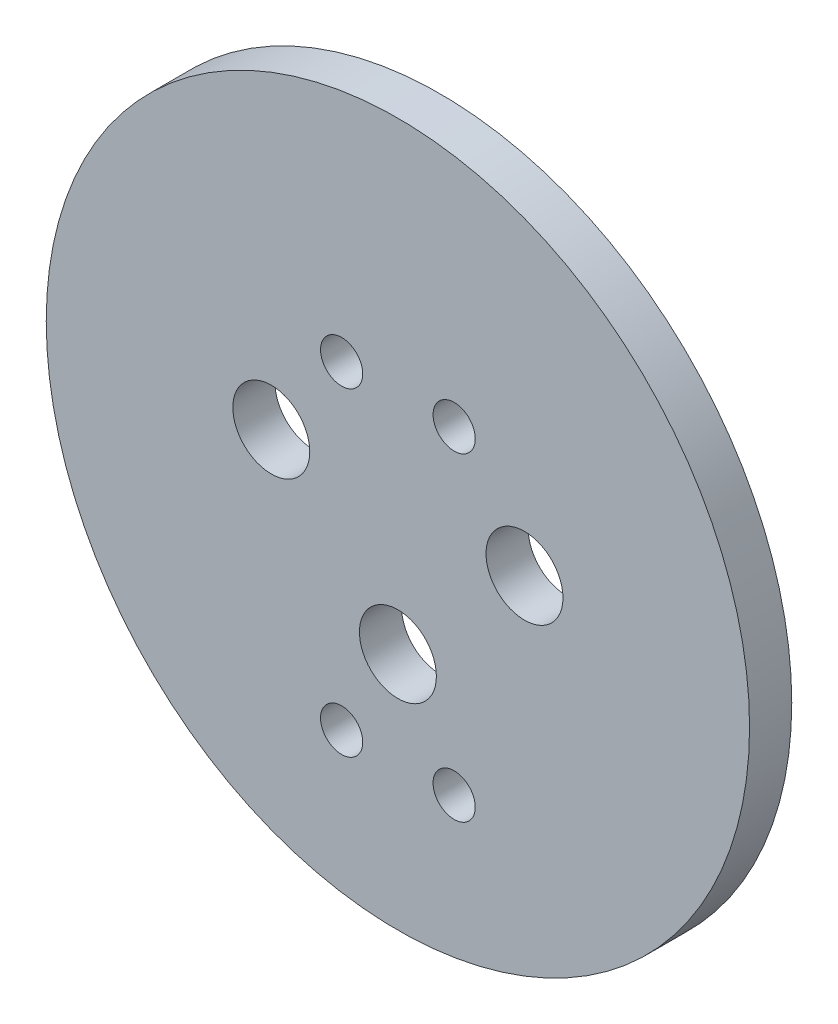
ISO-10303-21;
HEADER;
FILE_DESCRIPTION(('STEP AP214'),'2;1');
FILE_NAME('part.step','',(''),(''),'','','');
FILE_SCHEMA(('AUTOMOTIVE_DESIGN { 1 0 10303 214 1 1 1 1 }'));
ENDSEC;
DATA;
#1=APPLICATION_CONTEXT('core data for automotive mechanical design processes');
#2=APPLICATION_PROTOCOL_DEFINITION('international standard','automotive_design',2000,#1);
#3=PRODUCT_CONTEXT('',#1,'mechanical');
#4=PRODUCT('Part','Part','',(#3));
#5=PRODUCT_RELATED_PRODUCT_CATEGORY('part','',(#4));
#6=PRODUCT_DEFINITION_FORMATION('','',#4);
#7=PRODUCT_DEFINITION_CONTEXT('part definition',#1,'design');
#8=PRODUCT_DEFINITION('design','',#6,#7);
#9=PRODUCT_DEFINITION_SHAPE('','',#8);
#10=(LENGTH_UNIT() NAMED_UNIT(*) SI_UNIT(.MILLI.,.METRE.));
#11=(NAMED_UNIT(*) PLANE_ANGLE_UNIT() SI_UNIT($,.RADIAN.));
#12=(NAMED_UNIT(*) SI_UNIT($,.STERADIAN.) SOLID_ANGLE_UNIT());
#13=UNCERTAINTY_MEASURE_WITH_UNIT(LENGTH_MEASURE(1.E-05),#10,'distance_accuracy_value','');
#14=(GEOMETRIC_REPRESENTATION_CONTEXT(3) GLOBAL_UNCERTAINTY_ASSIGNED_CONTEXT((#13)) GLOBAL_UNIT_ASSIGNED_CONTEXT((#10,
#11,#12)) REPRESENTATION_CONTEXT('',''));
#15=CARTESIAN_POINT('',(0.,0.,0.));
#16=DIRECTION('',(0.,0.,1.));
#17=DIRECTION('',(1.,0.,0.));
#18=AXIS2_PLACEMENT_3D('',#15,#16,#17);
#19=CARTESIAN_POINT('',(0.,0.,3.));
#20=DIRECTION('',(0.,0.,-1.));
#21=DIRECTION('',(-1.,0.,0.));
#22=AXIS2_PLACEMENT_3D('',#19,#20,#21);
#23=CYLINDRICAL_SURFACE('',#22,25.);
#24=CARTESIAN_POINT('',(0.,0.,3.));
#25=DIRECTION('',(0.,0.,1.));
#26=DIRECTION('',(1.,0.,0.));
#27=AXIS2_PLACEMENT_3D('',#24,#25,#26);
#28=CIRCLE('',#27,25.);
#29=CARTESIAN_POINT('',(25.,0.,3.));
#30=VERTEX_POINT('',#29);
#31=EDGE_CURVE('E10',#30,#30,#28,.T.);
#32=ORIENTED_EDGE('',*,*,#31,.F.);
#33=EDGE_LOOP('',(#32));
#34=FACE_BOUND('',#33,.T.);
#35=CARTESIAN_POINT('',(0.,0.,0.));
#36=DIRECTION('',(0.,0.,1.));
#37=DIRECTION('',(1.,0.,0.));
#38=AXIS2_PLACEMENT_3D('',#35,#36,#37);
#39=CIRCLE('',#38,25.);
#40=CARTESIAN_POINT('',(25.,0.,0.));
#41=VERTEX_POINT('',#40);
#42=EDGE_CURVE('E43',#41,#41,#39,.T.);
#43=ORIENTED_EDGE('',*,*,#42,.T.);
#44=EDGE_LOOP('',(#43));
#45=FACE_BOUND('',#44,.T.);
#46=ADVANCED_FACE('F40',(#34,#45),#23,.T.);
#47=CARTESIAN_POINT('',(0.,0.,3.));
#48=DIRECTION('',(0.,0.,1.));
#49=DIRECTION('',(1.,0.,0.));
#50=AXIS2_PLACEMENT_3D('',#47,#48,#49);
#51=PLANE('',#50);
#52=CARTESIAN_POINT('',(0.,-8.,3.));
#53=DIRECTION('',(0.,0.,1.));
#54=DIRECTION('',(1.,0.,0.));
#55=AXIS2_PLACEMENT_3D('',#52,#53,#54);
#56=CIRCLE('',#55,2.735);
#57=CARTESIAN_POINT('',(2.735,-8.,3.));
#58=VERTEX_POINT('',#57);
#59=EDGE_CURVE('E82',#58,#58,#56,.T.);
#60=ORIENTED_EDGE('',*,*,#59,.F.);
#61=EDGE_LOOP('',(#60));
#62=FACE_BOUND('',#61,.T.);
#63=CARTESIAN_POINT('',(-4.,-14.6779253585061,3.));
#64=DIRECTION('',(0.,0.,1.));
#65=DIRECTION('',(-1.,0.,0.));
#66=AXIS2_PLACEMENT_3D('',#63,#64,#65);
#67=CIRCLE('',#66,1.5);
#68=CARTESIAN_POINT('',(-5.5,-14.6779253585061,3.));
#69=VERTEX_POINT('',#68);
#70=EDGE_CURVE('E67',#69,#69,#67,.T.);
#71=ORIENTED_EDGE('',*,*,#70,.F.);
#72=EDGE_LOOP('',(#71));
#73=FACE_BOUND('',#72,.T.);
#74=CARTESIAN_POINT('',(4.,-14.6779253585061,3.));
#75=DIRECTION('',(0.,0.,1.));
#76=DIRECTION('',(-1.,0.,0.));
#77=AXIS2_PLACEMENT_3D('',#74,#75,#76);
#78=CIRCLE('',#77,1.5);
#79=CARTESIAN_POINT('',(2.5,-14.6779253585061,3.));
#80=VERTEX_POINT('',#79);
#81=EDGE_CURVE('E66',#80,#80,#78,.T.);
#82=ORIENTED_EDGE('',*,*,#81,.F.);
#83=EDGE_LOOP('',(#82));
#84=FACE_BOUND('',#83,.T.);
#85=CARTESIAN_POINT('',(4.,8.,3.));
#86=DIRECTION('',(0.,0.,1.));
#87=DIRECTION('',(1.,0.,0.));
#88=AXIS2_PLACEMENT_3D('',#85,#86,#87);
#89=CIRCLE('',#88,1.5);
#90=CARTESIAN_POINT('',(5.5,8.,3.));
#91=VERTEX_POINT('',#90);
#92=EDGE_CURVE('E58',#91,#91,#89,.T.);
#93=ORIENTED_EDGE('',*,*,#92,.F.);
#94=EDGE_LOOP('',(#93));
#95=FACE_BOUND('',#94,.T.);
#96=CARTESIAN_POINT('',(9.,1.32380757938121,3.));
#97=DIRECTION('',(0.,0.,1.));
#98=DIRECTION('',(1.,0.,0.));
#99=AXIS2_PLACEMENT_3D('',#96,#97,#98);
#100=CIRCLE('',#99,2.735);
#101=CARTESIAN_POINT('',(11.735,1.32380757938121,3.));
#102=VERTEX_POINT('',#101);
#103=EDGE_CURVE('E83',#102,#102,#100,.T.);
#104=ORIENTED_EDGE('',*,*,#103,.F.);
#105=EDGE_LOOP('',(#104));
#106=FACE_BOUND('',#105,.T.);
#107=CARTESIAN_POINT('',(-9.,1.32380757938121,3.));
#108=DIRECTION('',(0.,0.,1.));
#109=DIRECTION('',(1.,0.,0.));
#110=AXIS2_PLACEMENT_3D('',#107,#108,#109);
#111=CIRCLE('',#110,2.735);
#112=CARTESIAN_POINT('',(-6.265,1.32380757938121,3.));
#113=VERTEX_POINT('',#112);
#114=EDGE_CURVE('E98',#113,#113,#111,.T.);
#115=ORIENTED_EDGE('',*,*,#114,.F.);
#116=EDGE_LOOP('',(#115));
#117=FACE_BOUND('',#116,.T.);
#118=CARTESIAN_POINT('',(-4.,8.,3.));
#119=DIRECTION('',(0.,0.,1.));
#120=DIRECTION('',(1.,0.,0.));
#121=AXIS2_PLACEMENT_3D('',#118,#119,#120);
#122=CIRCLE('',#121,1.5);
#123=CARTESIAN_POINT('',(-2.5,8.,3.));
#124=VERTEX_POINT('',#123);
#125=EDGE_CURVE('E54',#124,#124,#122,.T.);
#126=ORIENTED_EDGE('',*,*,#125,.F.);
#127=EDGE_LOOP('',(#126));
#128=FACE_BOUND('',#127,.T.);
#129=ORIENTED_EDGE('',*,*,#31,.T.);
#130=EDGE_LOOP('',(#129));
#131=FACE_BOUND('',#130,.T.);
#132=ADVANCED_FACE('F112',(#62,#73,#84,#95,#106,#117,#128,#131),#51,.T.);
#133=CARTESIAN_POINT('',(0.,0.,0.));
#134=DIRECTION('',(0.,0.,1.));
#135=DIRECTION('',(1.,0.,0.));
#136=AXIS2_PLACEMENT_3D('',#133,#134,#135);
#137=PLANE('',#136);
#138=CARTESIAN_POINT('',(0.,-8.,0.));
#139=DIRECTION('',(0.,0.,1.));
#140=DIRECTION('',(1.,0.,0.));
#141=AXIS2_PLACEMENT_3D('',#138,#139,#140);
#142=CIRCLE('',#141,2.735);
#143=CARTESIAN_POINT('',(2.735,-8.,0.));
#144=VERTEX_POINT('',#143);
#145=EDGE_CURVE('E78',#144,#144,#142,.T.);
#146=ORIENTED_EDGE('',*,*,#145,.T.);
#147=EDGE_LOOP('',(#146));
#148=FACE_BOUND('',#147,.T.);
#149=CARTESIAN_POINT('',(-4.,-14.6779253585061,0.));
#150=DIRECTION('',(0.,0.,1.));
#151=DIRECTION('',(-1.,0.,0.));
#152=AXIS2_PLACEMENT_3D('',#149,#150,#151);
#153=CIRCLE('',#152,1.5);
#154=CARTESIAN_POINT('',(-5.5,-14.6779253585061,0.));
#155=VERTEX_POINT('',#154);
#156=EDGE_CURVE('E87',#155,#155,#153,.T.);
#157=ORIENTED_EDGE('',*,*,#156,.T.);
#158=EDGE_LOOP('',(#157));
#159=FACE_BOUND('',#158,.T.);
#160=CARTESIAN_POINT('',(4.,-14.6779253585061,0.));
#161=DIRECTION('',(0.,0.,1.));
#162=DIRECTION('',(-1.,0.,0.));
#163=AXIS2_PLACEMENT_3D('',#160,#161,#162);
#164=CIRCLE('',#163,1.5);
#165=CARTESIAN_POINT('',(2.5,-14.6779253585061,0.));
#166=VERTEX_POINT('',#165);
#167=EDGE_CURVE('E62',#166,#166,#164,.T.);
#168=ORIENTED_EDGE('',*,*,#167,.T.);
#169=EDGE_LOOP('',(#168));
#170=FACE_BOUND('',#169,.T.);
#171=CARTESIAN_POINT('',(4.,8.,0.));
#172=DIRECTION('',(0.,0.,1.));
#173=DIRECTION('',(1.,0.,0.));
#174=AXIS2_PLACEMENT_3D('',#171,#172,#173);
#175=CIRCLE('',#174,1.5);
#176=CARTESIAN_POINT('',(5.5,8.,0.));
#177=VERTEX_POINT('',#176);
#178=EDGE_CURVE('E71',#177,#177,#175,.T.);
#179=ORIENTED_EDGE('',*,*,#178,.T.);
#180=EDGE_LOOP('',(#179));
#181=FACE_BOUND('',#180,.T.);
#182=CARTESIAN_POINT('',(9.,1.32380757938121,0.));
#183=DIRECTION('',(0.,0.,1.));
#184=DIRECTION('',(1.,0.,0.));
#185=AXIS2_PLACEMENT_3D('',#182,#183,#184);
#186=CIRCLE('',#185,2.735);
#187=CARTESIAN_POINT('',(11.735,1.32380757938121,0.));
#188=VERTEX_POINT('',#187);
#189=EDGE_CURVE('E102',#188,#188,#186,.T.);
#190=ORIENTED_EDGE('',*,*,#189,.T.);
#191=EDGE_LOOP('',(#190));
#192=FACE_BOUND('',#191,.T.);
#193=CARTESIAN_POINT('',(-9.,1.32380757938121,0.));
#194=DIRECTION('',(0.,0.,1.));
#195=DIRECTION('',(1.,0.,0.));
#196=AXIS2_PLACEMENT_3D('',#193,#194,#195);
#197=CIRCLE('',#196,2.735);
#198=CARTESIAN_POINT('',(-6.265,1.32380757938121,0.));
#199=VERTEX_POINT('',#198);
#200=EDGE_CURVE('E94',#199,#199,#197,.T.);
#201=ORIENTED_EDGE('',*,*,#200,.T.);
#202=EDGE_LOOP('',(#201));
#203=FACE_BOUND('',#202,.T.);
#204=CARTESIAN_POINT('',(-4.,8.,0.));
#205=DIRECTION('',(0.,0.,1.));
#206=DIRECTION('',(1.,0.,0.));
#207=AXIS2_PLACEMENT_3D('',#204,#205,#206);
#208=CIRCLE('',#207,1.5);
#209=CARTESIAN_POINT('',(-2.5,8.,0.));
#210=VERTEX_POINT('',#209);
#211=EDGE_CURVE('E52',#210,#210,#208,.T.);
#212=ORIENTED_EDGE('',*,*,#211,.T.);
#213=EDGE_LOOP('',(#212));
#214=FACE_BOUND('',#213,.T.);
#215=ORIENTED_EDGE('',*,*,#42,.F.);
#216=EDGE_LOOP('',(#215));
#217=FACE_BOUND('',#216,.T.);
#218=ADVANCED_FACE('F115',(#148,#159,#170,#181,#192,#203,#214,#217),#137,.F.);
#219=CARTESIAN_POINT('',(-4.,8.,0.));
#220=DIRECTION('',(0.,0.,1.));
#221=DIRECTION('',(1.,0.,0.));
#222=AXIS2_PLACEMENT_3D('',#219,#220,#221);
#223=CYLINDRICAL_SURFACE('',#222,1.5);
#224=ORIENTED_EDGE('',*,*,#211,.F.);
#225=EDGE_LOOP('',(#224));
#226=FACE_BOUND('',#225,.T.);
#227=ORIENTED_EDGE('',*,*,#125,.T.);
#228=EDGE_LOOP('',(#227));
#229=FACE_BOUND('',#228,.T.);
#230=ADVANCED_FACE('F122',(#226,#229),#223,.F.);
#231=CARTESIAN_POINT('',(-9.,1.32380757938121,0.));
#232=DIRECTION('',(0.,0.,1.));
#233=DIRECTION('',(1.,0.,0.));
#234=AXIS2_PLACEMENT_3D('',#231,#232,#233);
#235=CYLINDRICAL_SURFACE('',#234,2.735);
#236=ORIENTED_EDGE('',*,*,#200,.F.);
#237=EDGE_LOOP('',(#236));
#238=FACE_BOUND('',#237,.T.);
#239=ORIENTED_EDGE('',*,*,#114,.T.);
#240=EDGE_LOOP('',(#239));
#241=FACE_BOUND('',#240,.T.);
#242=ADVANCED_FACE('F124',(#238,#241),#235,.F.);
#243=CARTESIAN_POINT('',(9.,1.32380757938121,0.));
#244=DIRECTION('',(0.,0.,1.));
#245=DIRECTION('',(1.,0.,0.));
#246=AXIS2_PLACEMENT_3D('',#243,#244,#245);
#247=CYLINDRICAL_SURFACE('',#246,2.735);
#248=ORIENTED_EDGE('',*,*,#189,.F.);
#249=EDGE_LOOP('',(#248));
#250=FACE_BOUND('',#249,.T.);
#251=ORIENTED_EDGE('',*,*,#103,.T.);
#252=EDGE_LOOP('',(#251));
#253=FACE_BOUND('',#252,.T.);
#254=ADVANCED_FACE('F110',(#250,#253),#247,.F.);
#255=CARTESIAN_POINT('',(4.,8.,0.));
#256=DIRECTION('',(0.,0.,1.));
#257=DIRECTION('',(1.,0.,0.));
#258=AXIS2_PLACEMENT_3D('',#255,#256,#257);
#259=CYLINDRICAL_SURFACE('',#258,1.5);
#260=ORIENTED_EDGE('',*,*,#178,.F.);
#261=EDGE_LOOP('',(#260));
#262=FACE_BOUND('',#261,.T.);
#263=ORIENTED_EDGE('',*,*,#92,.T.);
#264=EDGE_LOOP('',(#263));
#265=FACE_BOUND('',#264,.T.);
#266=ADVANCED_FACE('F173',(#262,#265),#259,.F.);
#267=CARTESIAN_POINT('',(4.,-14.6779253585061,0.));
#268=DIRECTION('',(0.,0.,1.));
#269=DIRECTION('',(1.,0.,0.));
#270=AXIS2_PLACEMENT_3D('',#267,#268,#269);
#271=CYLINDRICAL_SURFACE('',#270,1.5);
#272=ORIENTED_EDGE('',*,*,#167,.F.);
#273=EDGE_LOOP('',(#272));
#274=FACE_BOUND('',#273,.T.);
#275=ORIENTED_EDGE('',*,*,#81,.T.);
#276=EDGE_LOOP('',(#275));
#277=FACE_BOUND('',#276,.T.);
#278=ADVANCED_FACE('F184',(#274,#277),#271,.F.);
#279=CARTESIAN_POINT('',(-4.,-14.6779253585061,0.));
#280=DIRECTION('',(0.,0.,1.));
#281=DIRECTION('',(1.,0.,0.));
#282=AXIS2_PLACEMENT_3D('',#279,#280,#281);
#283=CYLINDRICAL_SURFACE('',#282,1.5);
#284=ORIENTED_EDGE('',*,*,#156,.F.);
#285=EDGE_LOOP('',(#284));
#286=FACE_BOUND('',#285,.T.);
#287=ORIENTED_EDGE('',*,*,#70,.T.);
#288=EDGE_LOOP('',(#287));
#289=FACE_BOUND('',#288,.T.);
#290=ADVANCED_FACE('F195',(#286,#289),#283,.F.);
#291=CARTESIAN_POINT('',(0.,-8.,0.));
#292=DIRECTION('',(0.,0.,1.));
#293=DIRECTION('',(1.,0.,0.));
#294=AXIS2_PLACEMENT_3D('',#291,#292,#293);
#295=CYLINDRICAL_SURFACE('',#294,2.735);
#296=ORIENTED_EDGE('',*,*,#145,.F.);
#297=EDGE_LOOP('',(#296));
#298=FACE_BOUND('',#297,.T.);
#299=ORIENTED_EDGE('',*,*,#59,.T.);
#300=EDGE_LOOP('',(#299));
#301=FACE_BOUND('',#300,.T.);
#302=ADVANCED_FACE('F205',(#298,#301),#295,.F.);
#303=CLOSED_SHELL('',(#46,#132,#218,#230,#242,#254,#266,#278,#290,#302));
#304=MANIFOLD_SOLID_BREP('B2',#303);
#305=ADVANCED_BREP_SHAPE_REPRESENTATION('',(#18,#304),#14);
#306=SHAPE_DEFINITION_REPRESENTATION(#9,#305);
ENDSEC;
END-ISO-10303-21;
